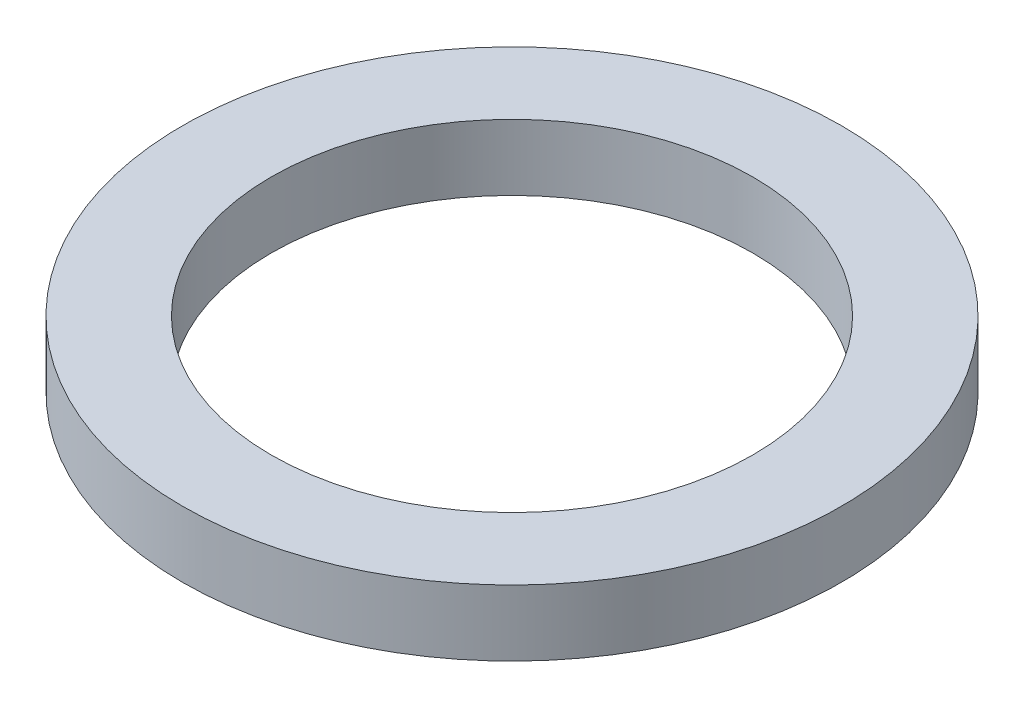
ISO-10303-21;
HEADER;
FILE_DESCRIPTION(('STEP AP214'),'2;1');
FILE_NAME('part.step','',(''),(''),'','','');
FILE_SCHEMA(('AUTOMOTIVE_DESIGN { 1 0 10303 214 1 1 1 1 }'));
ENDSEC;
DATA;
#1=APPLICATION_CONTEXT('core data for automotive mechanical design processes');
#2=APPLICATION_PROTOCOL_DEFINITION('international standard','automotive_design',2000,#1);
#3=PRODUCT_CONTEXT('',#1,'mechanical');
#4=PRODUCT('Part','Part','',(#3));
#5=PRODUCT_RELATED_PRODUCT_CATEGORY('part','',(#4));
#6=PRODUCT_DEFINITION_FORMATION('','',#4);
#7=PRODUCT_DEFINITION_CONTEXT('part definition',#1,'design');
#8=PRODUCT_DEFINITION('design','',#6,#7);
#9=PRODUCT_DEFINITION_SHAPE('','',#8);
#10=(LENGTH_UNIT() NAMED_UNIT(*) SI_UNIT(.MILLI.,.METRE.));
#11=(NAMED_UNIT(*) PLANE_ANGLE_UNIT() SI_UNIT($,.RADIAN.));
#12=(NAMED_UNIT(*) SI_UNIT($,.STERADIAN.) SOLID_ANGLE_UNIT());
#13=UNCERTAINTY_MEASURE_WITH_UNIT(LENGTH_MEASURE(1.E-05),#10,'distance_accuracy_value','');
#14=(GEOMETRIC_REPRESENTATION_CONTEXT(3) GLOBAL_UNCERTAINTY_ASSIGNED_CONTEXT((#13)) GLOBAL_UNIT_ASSIGNED_CONTEXT((#10,
#11,#12)) REPRESENTATION_CONTEXT('',''));
#15=CARTESIAN_POINT('',(0.,0.,0.));
#16=DIRECTION('',(0.,0.,1.));
#17=DIRECTION('',(1.,0.,0.));
#18=AXIS2_PLACEMENT_3D('',#15,#16,#17);
#19=CARTESIAN_POINT('',(0.,13.,0.));
#20=DIRECTION('',(0.,-1.,0.));
#21=DIRECTION('',(0.,0.,-1.));
#22=AXIS2_PLACEMENT_3D('',#19,#20,#21);
#23=CYLINDRICAL_SURFACE('',#22,65.);
#24=CARTESIAN_POINT('',(0.,13.,0.));
#25=DIRECTION('',(0.,1.,0.));
#26=DIRECTION('',(0.,0.,1.));
#27=AXIS2_PLACEMENT_3D('',#24,#25,#26);
#28=CIRCLE('',#27,65.);
#29=CARTESIAN_POINT('',(0.,13.,-65.));
#30=VERTEX_POINT('',#29);
#31=EDGE_CURVE('E10',#30,#30,#28,.T.);
#32=CARTESIAN_POINT('',(0.,0.,0.));
#33=DIRECTION('',(0.,1.,0.));
#34=DIRECTION('',(0.,0.,1.));
#35=AXIS2_PLACEMENT_3D('',#32,#33,#34);
#36=CIRCLE('',#35,65.);
#37=CARTESIAN_POINT('',(0.,0.,-65.));
#38=VERTEX_POINT('',#37);
#39=EDGE_CURVE('E37',#38,#38,#36,.T.);
#40=CARTESIAN_POINT('',(0.,13.,-65.));
#41=CARTESIAN_POINT('',(0.,12.8645833333333,-65.));
#42=CARTESIAN_POINT('',(0.,12.7291666666667,-65.));
#43=CARTESIAN_POINT('',(0.,12.4583333333333,-65.));
#44=CARTESIAN_POINT('',(0.,12.3229166666667,-65.));
#45=CARTESIAN_POINT('',(0.,12.0520833333333,-65.));
#46=CARTESIAN_POINT('',(0.,11.9166666666667,-65.));
#47=CARTESIAN_POINT('',(0.,11.6458333333333,-65.));
#48=CARTESIAN_POINT('',(0.,11.5104166666667,-65.));
#49=CARTESIAN_POINT('',(0.,11.2395833333333,-65.));
#50=CARTESIAN_POINT('',(0.,11.1041666666667,-65.));
#51=CARTESIAN_POINT('',(0.,10.8333333333333,-65.));
#52=CARTESIAN_POINT('',(0.,10.6979166666667,-65.));
#53=CARTESIAN_POINT('',(0.,10.4270833333333,-65.));
#54=CARTESIAN_POINT('',(0.,10.2916666666667,-65.));
#55=CARTESIAN_POINT('',(0.,10.0208333333333,-65.));
#56=CARTESIAN_POINT('',(0.,9.88541666666667,-65.));
#57=CARTESIAN_POINT('',(0.,9.61458333333333,-65.));
#58=CARTESIAN_POINT('',(0.,9.47916666666667,-65.));
#59=CARTESIAN_POINT('',(0.,9.20833333333333,-65.));
#60=CARTESIAN_POINT('',(0.,9.07291666666666,-65.));
#61=CARTESIAN_POINT('',(0.,8.80208333333333,-65.));
#62=CARTESIAN_POINT('',(0.,8.66666666666667,-65.));
#63=CARTESIAN_POINT('',(0.,8.39583333333333,-65.));
#64=CARTESIAN_POINT('',(0.,8.26041666666667,-65.));
#65=CARTESIAN_POINT('',(0.,7.98958333333333,-65.));
#66=CARTESIAN_POINT('',(0.,7.85416666666667,-65.));
#67=CARTESIAN_POINT('',(0.,7.58333333333333,-65.));
#68=CARTESIAN_POINT('',(0.,7.44791666666667,-65.));
#69=CARTESIAN_POINT('',(0.,7.17708333333333,-65.));
#70=CARTESIAN_POINT('',(0.,7.04166666666667,-65.));
#71=CARTESIAN_POINT('',(0.,6.77083333333333,-65.));
#72=CARTESIAN_POINT('',(0.,6.63541666666667,-65.));
#73=CARTESIAN_POINT('',(0.,6.36458333333333,-65.));
#74=CARTESIAN_POINT('',(0.,6.22916666666667,-65.));
#75=CARTESIAN_POINT('',(0.,5.95833333333333,-65.));
#76=CARTESIAN_POINT('',(0.,5.82291666666667,-65.));
#77=CARTESIAN_POINT('',(0.,5.55208333333333,-65.));
#78=CARTESIAN_POINT('',(0.,5.41666666666667,-65.));
#79=CARTESIAN_POINT('',(0.,5.14583333333333,-65.));
#80=CARTESIAN_POINT('',(0.,5.01041666666667,-65.));
#81=CARTESIAN_POINT('',(0.,4.73958333333333,-65.));
#82=CARTESIAN_POINT('',(0.,4.60416666666667,-65.));
#83=CARTESIAN_POINT('',(0.,4.33333333333333,-65.));
#84=CARTESIAN_POINT('',(0.,4.19791666666667,-65.));
#85=CARTESIAN_POINT('',(0.,3.92708333333333,-65.));
#86=CARTESIAN_POINT('',(0.,3.79166666666667,-65.));
#87=CARTESIAN_POINT('',(0.,3.52083333333333,-65.));
#88=CARTESIAN_POINT('',(0.,3.38541666666667,-65.));
#89=CARTESIAN_POINT('',(0.,3.11458333333333,-65.));
#90=CARTESIAN_POINT('',(0.,2.97916666666667,-65.));
#91=CARTESIAN_POINT('',(0.,2.70833333333333,-65.));
#92=CARTESIAN_POINT('',(0.,2.57291666666667,-65.));
#93=CARTESIAN_POINT('',(0.,2.30208333333333,-65.));
#94=CARTESIAN_POINT('',(0.,2.16666666666667,-65.));
#95=CARTESIAN_POINT('',(0.,1.89583333333333,-65.));
#96=CARTESIAN_POINT('',(0.,1.76041666666667,-65.));
#97=CARTESIAN_POINT('',(0.,1.48958333333333,-65.));
#98=CARTESIAN_POINT('',(0.,1.35416666666667,-65.));
#99=CARTESIAN_POINT('',(0.,1.08333333333333,-65.));
#100=CARTESIAN_POINT('',(0.,0.947916666666667,-65.));
#101=CARTESIAN_POINT('',(0.,0.677083333333334,-65.));
#102=CARTESIAN_POINT('',(0.,0.541666666666667,-65.));
#103=CARTESIAN_POINT('',(0.,0.270833333333334,-65.));
#104=CARTESIAN_POINT('',(0.,0.135416666666667,-65.));
#105=CARTESIAN_POINT('',(0.,0.,-65.));
#106=B_SPLINE_CURVE_WITH_KNOTS('',3,(#40,#41,#42,#43,#44,#45,#46,#47,#48,#49,#50,#51,#52,#53,
#54,#55,#56,#57,#58,#59,#60,#61,#62,#63,#64,#65,#66,#67,#68,#69,#70,#71,#72,#73,#74,#75,#76,#77,
#78,#79,#80,#81,#82,#83,#84,#85,#86,#87,#88,#89,#90,#91,#92,#93,#94,#95,#96,#97,#98,#99,#100,
#101,#102,#103,#104,#105),.UNSPECIFIED.,.F.,.F.,(4,2,2,2,2,2,2,2,2,2,2,2,2,2,2,2,2,2,2,2,2,2,2,
2,2,2,2,2,2,2,2,2,4),(0.,0.40625,0.812500000000001,1.21875,1.625,2.03125,2.4375,2.84375,3.25,
3.65625,4.0625,4.46875,4.875,5.28125,5.6875,6.09375,6.5,6.90625,7.3125,7.71875,8.125,8.53125,
8.9375,9.34375,9.75,10.15625,10.5625,10.96875,11.375,11.78125,12.1875,12.59375,13.),.UNSPECIFIED.);
#107=EDGE_CURVE('BSEAM40',#30,#38,#106,.T.);
#108=ORIENTED_EDGE('',*,*,#31,.F.);
#109=ORIENTED_EDGE('',*,*,#39,.T.);
#110=ORIENTED_EDGE('',*,*,#107,.T.);
#111=ORIENTED_EDGE('',*,*,#107,.F.);
#112=EDGE_LOOP('',(#108,#110,#109,#111));
#113=FACE_BOUND('',#112,.T.);
#114=ADVANCED_FACE('F40',(#113),#23,.T.);
#115=CARTESIAN_POINT('',(0.,13.,0.));
#116=DIRECTION('',(0.,1.,0.));
#117=DIRECTION('',(0.,0.,1.));
#118=AXIS2_PLACEMENT_3D('',#115,#116,#117);
#119=PLANE('',#118);
#120=CARTESIAN_POINT('',(0.,13.,0.));
#121=DIRECTION('',(0.,1.,0.));
#122=DIRECTION('',(0.,0.,1.));
#123=AXIS2_PLACEMENT_3D('',#120,#121,#122);
#124=CIRCLE('',#123,47.5);
#125=CARTESIAN_POINT('',(0.,13.,-47.5));
#126=VERTEX_POINT('',#125);
#127=EDGE_CURVE('E50',#126,#126,#124,.T.);
#128=ORIENTED_EDGE('',*,*,#127,.F.);
#129=EDGE_LOOP('',(#128));
#130=FACE_BOUND('',#129,.T.);
#131=ORIENTED_EDGE('',*,*,#31,.T.);
#132=EDGE_LOOP('',(#131));
#133=FACE_BOUND('',#132,.T.);
#134=ADVANCED_FACE('F59',(#130,#133),#119,.T.);
#135=CARTESIAN_POINT('',(0.,0.,0.));
#136=DIRECTION('',(0.,1.,0.));
#137=DIRECTION('',(0.,0.,1.));
#138=AXIS2_PLACEMENT_3D('',#135,#136,#137);
#139=PLANE('',#138);
#140=CARTESIAN_POINT('',(0.,0.,0.));
#141=DIRECTION('',(0.,1.,0.));
#142=DIRECTION('',(0.,0.,1.));
#143=AXIS2_PLACEMENT_3D('',#140,#141,#142);
#144=CIRCLE('',#143,47.5);
#145=CARTESIAN_POINT('',(0.,0.,-47.5));
#146=VERTEX_POINT('',#145);
#147=EDGE_CURVE('E47',#146,#146,#144,.T.);
#148=ORIENTED_EDGE('',*,*,#147,.T.);
#149=EDGE_LOOP('',(#148));
#150=FACE_BOUND('',#149,.T.);
#151=ORIENTED_EDGE('',*,*,#39,.F.);
#152=EDGE_LOOP('',(#151));
#153=FACE_BOUND('',#152,.T.);
#154=ADVANCED_FACE('F58',(#150,#153),#139,.F.);
#155=CARTESIAN_POINT('',(0.,13.,0.));
#156=DIRECTION('',(0.,-1.,0.));
#157=DIRECTION('',(0.,0.,-1.));
#158=AXIS2_PLACEMENT_3D('',#155,#156,#157);
#159=CYLINDRICAL_SURFACE('',#158,47.5);
#160=CARTESIAN_POINT('',(0.,13.,-47.5));
#161=CARTESIAN_POINT('',(0.,12.8645833333333,-47.5));
#162=CARTESIAN_POINT('',(0.,12.7291666666667,-47.5));
#163=CARTESIAN_POINT('',(0.,12.4583333333333,-47.5));
#164=CARTESIAN_POINT('',(0.,12.3229166666667,-47.5));
#165=CARTESIAN_POINT('',(0.,12.0520833333333,-47.5));
#166=CARTESIAN_POINT('',(0.,11.9166666666667,-47.5));
#167=CARTESIAN_POINT('',(0.,11.6458333333333,-47.5));
#168=CARTESIAN_POINT('',(0.,11.5104166666667,-47.5));
#169=CARTESIAN_POINT('',(0.,11.2395833333333,-47.5));
#170=CARTESIAN_POINT('',(0.,11.1041666666667,-47.5));
#171=CARTESIAN_POINT('',(0.,10.8333333333333,-47.5));
#172=CARTESIAN_POINT('',(0.,10.6979166666667,-47.5));
#173=CARTESIAN_POINT('',(0.,10.4270833333333,-47.5));
#174=CARTESIAN_POINT('',(0.,10.2916666666667,-47.5));
#175=CARTESIAN_POINT('',(0.,10.0208333333333,-47.5));
#176=CARTESIAN_POINT('',(0.,9.88541666666667,-47.5));
#177=CARTESIAN_POINT('',(0.,9.61458333333333,-47.5));
#178=CARTESIAN_POINT('',(0.,9.47916666666667,-47.5));
#179=CARTESIAN_POINT('',(0.,9.20833333333333,-47.5));
#180=CARTESIAN_POINT('',(0.,9.07291666666666,-47.5));
#181=CARTESIAN_POINT('',(0.,8.80208333333333,-47.5));
#182=CARTESIAN_POINT('',(0.,8.66666666666667,-47.5));
#183=CARTESIAN_POINT('',(0.,8.39583333333333,-47.5));
#184=CARTESIAN_POINT('',(0.,8.26041666666667,-47.5));
#185=CARTESIAN_POINT('',(0.,7.98958333333333,-47.5));
#186=CARTESIAN_POINT('',(0.,7.85416666666667,-47.5));
#187=CARTESIAN_POINT('',(0.,7.58333333333333,-47.5));
#188=CARTESIAN_POINT('',(0.,7.44791666666667,-47.5));
#189=CARTESIAN_POINT('',(0.,7.17708333333333,-47.5));
#190=CARTESIAN_POINT('',(0.,7.04166666666667,-47.5));
#191=CARTESIAN_POINT('',(0.,6.77083333333333,-47.5));
#192=CARTESIAN_POINT('',(0.,6.63541666666667,-47.5));
#193=CARTESIAN_POINT('',(0.,6.36458333333333,-47.5));
#194=CARTESIAN_POINT('',(0.,6.22916666666667,-47.5));
#195=CARTESIAN_POINT('',(0.,5.95833333333333,-47.5));
#196=CARTESIAN_POINT('',(0.,5.82291666666667,-47.5));
#197=CARTESIAN_POINT('',(0.,5.55208333333333,-47.5));
#198=CARTESIAN_POINT('',(0.,5.41666666666667,-47.5));
#199=CARTESIAN_POINT('',(0.,5.14583333333333,-47.5));
#200=CARTESIAN_POINT('',(0.,5.01041666666667,-47.5));
#201=CARTESIAN_POINT('',(0.,4.73958333333333,-47.5));
#202=CARTESIAN_POINT('',(0.,4.60416666666667,-47.5));
#203=CARTESIAN_POINT('',(0.,4.33333333333333,-47.5));
#204=CARTESIAN_POINT('',(0.,4.19791666666667,-47.5));
#205=CARTESIAN_POINT('',(0.,3.92708333333333,-47.5));
#206=CARTESIAN_POINT('',(0.,3.79166666666667,-47.5));
#207=CARTESIAN_POINT('',(0.,3.52083333333333,-47.5));
#208=CARTESIAN_POINT('',(0.,3.38541666666667,-47.5));
#209=CARTESIAN_POINT('',(0.,3.11458333333333,-47.5));
#210=CARTESIAN_POINT('',(0.,2.97916666666667,-47.5));
#211=CARTESIAN_POINT('',(0.,2.70833333333333,-47.5));
#212=CARTESIAN_POINT('',(0.,2.57291666666667,-47.5));
#213=CARTESIAN_POINT('',(0.,2.30208333333333,-47.5));
#214=CARTESIAN_POINT('',(0.,2.16666666666667,-47.5));
#215=CARTESIAN_POINT('',(0.,1.89583333333333,-47.5));
#216=CARTESIAN_POINT('',(0.,1.76041666666667,-47.5));
#217=CARTESIAN_POINT('',(0.,1.48958333333333,-47.5));
#218=CARTESIAN_POINT('',(0.,1.35416666666667,-47.5));
#219=CARTESIAN_POINT('',(0.,1.08333333333333,-47.5));
#220=CARTESIAN_POINT('',(0.,0.947916666666667,-47.5));
#221=CARTESIAN_POINT('',(0.,0.677083333333334,-47.5));
#222=CARTESIAN_POINT('',(0.,0.541666666666667,-47.5));
#223=CARTESIAN_POINT('',(0.,0.270833333333334,-47.5));
#224=CARTESIAN_POINT('',(0.,0.135416666666667,-47.5));
#225=CARTESIAN_POINT('',(0.,0.,-47.5));
#226=B_SPLINE_CURVE_WITH_KNOTS('',3,(#160,#161,#162,#163,#164,#165,#166,#167,#168,#169,#170,
#171,#172,#173,#174,#175,#176,#177,#178,#179,#180,#181,#182,#183,#184,#185,#186,#187,#188,#189,
#190,#191,#192,#193,#194,#195,#196,#197,#198,#199,#200,#201,#202,#203,#204,#205,#206,#207,#208,
#209,#210,#211,#212,#213,#214,#215,#216,#217,#218,#219,#220,#221,#222,#223,#224,#225),
.UNSPECIFIED.,.F.,.F.,(4,2,2,2,2,2,2,2,2,2,2,2,2,2,2,2,2,2,2,2,2,2,2,2,2,2,2,2,2,2,2,2,4),(0.,
0.40625,0.812500000000001,1.21875,1.625,2.03125,2.4375,2.84375,3.25,3.65625,4.0625,4.46875,
4.875,5.28125,5.6875,6.09375,6.5,6.90625,7.3125,7.71875,8.125,8.53125,8.9375,9.34375,9.75,
10.15625,10.5625,10.96875,11.375,11.78125,12.1875,12.59375,13.),.UNSPECIFIED.);
#227=EDGE_CURVE('BSEAM54',#126,#146,#226,.T.);
#228=ORIENTED_EDGE('',*,*,#127,.T.);
#229=ORIENTED_EDGE('',*,*,#147,.F.);
#230=ORIENTED_EDGE('',*,*,#227,.T.);
#231=ORIENTED_EDGE('',*,*,#227,.F.);
#232=EDGE_LOOP('',(#228,#230,#229,#231));
#233=FACE_BOUND('',#232,.T.);
#234=ADVANCED_FACE('F54',(#233),#159,.F.);
#235=CLOSED_SHELL('',(#114,#134,#154,#234));
#236=MANIFOLD_SOLID_BREP('B2',#235);
#237=ADVANCED_BREP_SHAPE_REPRESENTATION('',(#18,#236),#14);
#238=SHAPE_DEFINITION_REPRESENTATION(#9,#237);
ENDSEC;
END-ISO-10303-21;
